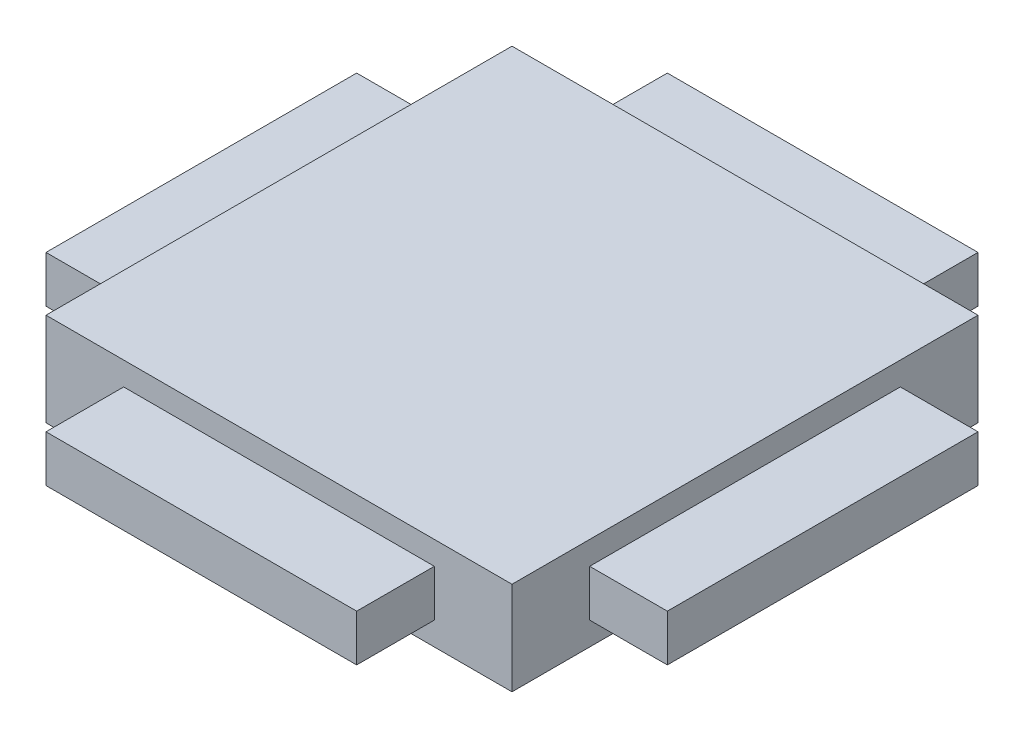
ISO-10303-21;
HEADER;
FILE_DESCRIPTION(('STEP AP214'),'2;1');
FILE_NAME('part.step','',(''),(''),'','','');
FILE_SCHEMA(('AUTOMOTIVE_DESIGN { 1 0 10303 214 1 1 1 1 }'));
ENDSEC;
DATA;
#1=APPLICATION_CONTEXT('core data for automotive mechanical design processes');
#2=APPLICATION_PROTOCOL_DEFINITION('international standard','automotive_design',2000,#1);
#3=PRODUCT_CONTEXT('',#1,'mechanical');
#4=PRODUCT('Part','Part','',(#3));
#5=PRODUCT_RELATED_PRODUCT_CATEGORY('part','',(#4));
#6=PRODUCT_DEFINITION_FORMATION('','',#4);
#7=PRODUCT_DEFINITION_CONTEXT('part definition',#1,'design');
#8=PRODUCT_DEFINITION('design','',#6,#7);
#9=PRODUCT_DEFINITION_SHAPE('','',#8);
#10=(LENGTH_UNIT() NAMED_UNIT(*) SI_UNIT(.MILLI.,.METRE.));
#11=(NAMED_UNIT(*) PLANE_ANGLE_UNIT() SI_UNIT($,.RADIAN.));
#12=(NAMED_UNIT(*) SI_UNIT($,.STERADIAN.) SOLID_ANGLE_UNIT());
#13=UNCERTAINTY_MEASURE_WITH_UNIT(LENGTH_MEASURE(1.E-05),#10,'distance_accuracy_value','');
#14=(GEOMETRIC_REPRESENTATION_CONTEXT(3) GLOBAL_UNCERTAINTY_ASSIGNED_CONTEXT((#13)) GLOBAL_UNIT_ASSIGNED_CONTEXT((#10,
#11,#12)) REPRESENTATION_CONTEXT('',''));
#15=CARTESIAN_POINT('',(0.,0.,0.));
#16=DIRECTION('',(0.,0.,1.));
#17=DIRECTION('',(1.,0.,0.));
#18=AXIS2_PLACEMENT_3D('',#15,#16,#17);
#19=CARTESIAN_POINT('',(0.,3.,7.5));
#20=DIRECTION('',(0.,0.,1.));
#21=DIRECTION('',(1.,0.,0.));
#22=AXIS2_PLACEMENT_3D('',#19,#20,#21);
#23=PLANE('',#22);
#24=DIRECTION('',(-1.,0.,0.));
#25=VECTOR('',#24,1.);
#26=CARTESIAN_POINT('',(0.,0.,7.5));
#27=LINE('',#26,#25);
#28=CARTESIAN_POINT('',(7.5,0.,7.5));
#29=VERTEX_POINT('',#28);
#30=CARTESIAN_POINT('',(-7.5,0.,7.5));
#31=VERTEX_POINT('',#30);
#32=EDGE_CURVE('E306',#29,#31,#27,.T.);
#33=ORIENTED_EDGE('',*,*,#32,.F.);
#34=DIRECTION('',(0.,-1.,0.));
#35=VECTOR('',#34,1.);
#36=CARTESIAN_POINT('',(7.5,3.,7.5));
#37=LINE('',#36,#35);
#38=CARTESIAN_POINT('',(7.5,3.,7.5));
#39=VERTEX_POINT('',#38);
#40=EDGE_CURVE('E44',#39,#29,#37,.T.);
#41=ORIENTED_EDGE('',*,*,#40,.F.);
#42=DIRECTION('',(-1.,0.,0.));
#43=VECTOR('',#42,1.);
#44=CARTESIAN_POINT('',(0.,3.,7.5));
#45=LINE('',#44,#43);
#46=CARTESIAN_POINT('',(-7.5,3.,7.5));
#47=VERTEX_POINT('',#46);
#48=EDGE_CURVE('E295',#39,#47,#45,.T.);
#49=ORIENTED_EDGE('',*,*,#48,.T.);
#50=DIRECTION('',(0.,-1.,0.));
#51=VECTOR('',#50,1.);
#52=CARTESIAN_POINT('',(-7.5,3.,7.5));
#53=LINE('',#52,#51);
#54=EDGE_CURVE('E11',#47,#31,#53,.T.);
#55=ORIENTED_EDGE('',*,*,#54,.T.);
#56=EDGE_LOOP('',(#33,#41,#49,#55));
#57=FACE_BOUND('',#56,.T.);
#58=DIRECTION('',(0.,1.,0.));
#59=VECTOR('',#58,1.);
#60=CARTESIAN_POINT('',(-5.,0.75,7.5));
#61=LINE('',#60,#59);
#62=CARTESIAN_POINT('',(-5.,0.75,7.5));
#63=VERTEX_POINT('',#62);
#64=CARTESIAN_POINT('',(-5.,2.25,7.5));
#65=VERTEX_POINT('',#64);
#66=EDGE_CURVE('E222',#63,#65,#61,.T.);
#67=ORIENTED_EDGE('',*,*,#66,.T.);
#68=DIRECTION('',(1.,0.,0.));
#69=VECTOR('',#68,1.);
#70=CARTESIAN_POINT('',(0.,2.25,7.5));
#71=LINE('',#70,#69);
#72=CARTESIAN_POINT('',(5.,2.25,7.5));
#73=VERTEX_POINT('',#72);
#74=EDGE_CURVE('E59',#65,#73,#71,.T.);
#75=ORIENTED_EDGE('',*,*,#74,.T.);
#76=DIRECTION('',(0.,1.,0.));
#77=VECTOR('',#76,1.);
#78=CARTESIAN_POINT('',(5.,0.75,7.5));
#79=LINE('',#78,#77);
#80=CARTESIAN_POINT('',(5.,0.75,7.5));
#81=VERTEX_POINT('',#80);
#82=EDGE_CURVE('E226',#81,#73,#79,.T.);
#83=ORIENTED_EDGE('',*,*,#82,.F.);
#84=DIRECTION('',(1.,0.,0.));
#85=VECTOR('',#84,1.);
#86=CARTESIAN_POINT('',(0.,0.75,7.5));
#87=LINE('',#86,#85);
#88=EDGE_CURVE('E219',#63,#81,#87,.T.);
#89=ORIENTED_EDGE('',*,*,#88,.F.);
#90=EDGE_LOOP('',(#67,#75,#83,#89));
#91=FACE_BOUND('',#90,.T.);
#92=ADVANCED_FACE('F36',(#57,#91),#23,.T.);
#93=CARTESIAN_POINT('',(-7.5,3.,0.));
#94=DIRECTION('',(-1.,0.,0.));
#95=DIRECTION('',(0.,0.,1.));
#96=AXIS2_PLACEMENT_3D('',#93,#94,#95);
#97=PLANE('',#96);
#98=DIRECTION('',(0.,0.,-1.));
#99=VECTOR('',#98,1.);
#100=CARTESIAN_POINT('',(-7.5,0.,0.));
#101=LINE('',#100,#99);
#102=CARTESIAN_POINT('',(-7.5,0.,-7.5));
#103=VERTEX_POINT('',#102);
#104=EDGE_CURVE('E285',#31,#103,#101,.T.);
#105=ORIENTED_EDGE('',*,*,#104,.F.);
#106=ORIENTED_EDGE('',*,*,#54,.F.);
#107=DIRECTION('',(0.,0.,-1.));
#108=VECTOR('',#107,1.);
#109=CARTESIAN_POINT('',(-7.5,3.,0.));
#110=LINE('',#109,#108);
#111=CARTESIAN_POINT('',(-7.5,3.,-7.5));
#112=VERTEX_POINT('',#111);
#113=EDGE_CURVE('E292',#47,#112,#110,.T.);
#114=ORIENTED_EDGE('',*,*,#113,.T.);
#115=DIRECTION('',(0.,-1.,0.));
#116=VECTOR('',#115,1.);
#117=CARTESIAN_POINT('',(-7.5,3.,-7.5));
#118=LINE('',#117,#116);
#119=EDGE_CURVE('E303',#112,#103,#118,.T.);
#120=ORIENTED_EDGE('',*,*,#119,.T.);
#121=EDGE_LOOP('',(#105,#106,#114,#120));
#122=FACE_BOUND('',#121,.T.);
#123=DIRECTION('',(0.,1.,0.));
#124=VECTOR('',#123,1.);
#125=CARTESIAN_POINT('',(-7.5,0.75,-5.));
#126=LINE('',#125,#124);
#127=CARTESIAN_POINT('',(-7.5,0.75,-5.));
#128=VERTEX_POINT('',#127);
#129=CARTESIAN_POINT('',(-7.5,2.25,-5.));
#130=VERTEX_POINT('',#129);
#131=EDGE_CURVE('E286',#128,#130,#126,.T.);
#132=ORIENTED_EDGE('',*,*,#131,.T.);
#133=DIRECTION('',(0.,0.,1.));
#134=VECTOR('',#133,1.);
#135=CARTESIAN_POINT('',(-7.5,2.25,0.));
#136=LINE('',#135,#134);
#137=CARTESIAN_POINT('',(-7.5,2.25,5.));
#138=VERTEX_POINT('',#137);
#139=EDGE_CURVE('E267',#130,#138,#136,.T.);
#140=ORIENTED_EDGE('',*,*,#139,.T.);
#141=DIRECTION('',(0.,1.,0.));
#142=VECTOR('',#141,1.);
#143=CARTESIAN_POINT('',(-7.5,0.75,5.));
#144=LINE('',#143,#142);
#145=CARTESIAN_POINT('',(-7.5,0.75,5.));
#146=VERTEX_POINT('',#145);
#147=EDGE_CURVE('E289',#146,#138,#144,.T.);
#148=ORIENTED_EDGE('',*,*,#147,.F.);
#149=DIRECTION('',(0.,0.,1.));
#150=VECTOR('',#149,1.);
#151=CARTESIAN_POINT('',(-7.5,0.75,0.));
#152=LINE('',#151,#150);
#153=EDGE_CURVE('E277',#128,#146,#152,.T.);
#154=ORIENTED_EDGE('',*,*,#153,.F.);
#155=EDGE_LOOP('',(#132,#140,#148,#154));
#156=FACE_BOUND('',#155,.T.);
#157=ADVANCED_FACE('F38',(#122,#156),#97,.T.);
#158=CARTESIAN_POINT('',(7.5,3.,0.));
#159=DIRECTION('',(-1.,0.,0.));
#160=DIRECTION('',(0.,0.,1.));
#161=AXIS2_PLACEMENT_3D('',#158,#159,#160);
#162=PLANE('',#161);
#163=DIRECTION('',(0.,0.,-1.));
#164=VECTOR('',#163,1.);
#165=CARTESIAN_POINT('',(7.5,2.25,0.));
#166=LINE('',#165,#164);
#167=CARTESIAN_POINT('',(7.5,2.25,5.));
#168=VERTEX_POINT('',#167);
#169=CARTESIAN_POINT('',(7.5,2.25,-5.));
#170=VERTEX_POINT('',#169);
#171=EDGE_CURVE('E241',#168,#170,#166,.T.);
#172=ORIENTED_EDGE('',*,*,#171,.T.);
#173=DIRECTION('',(0.,-1.,0.));
#174=VECTOR('',#173,1.);
#175=CARTESIAN_POINT('',(7.5,2.25,-5.));
#176=LINE('',#175,#174);
#177=CARTESIAN_POINT('',(7.5,0.75,-5.));
#178=VERTEX_POINT('',#177);
#179=EDGE_CURVE('E252',#170,#178,#176,.T.);
#180=ORIENTED_EDGE('',*,*,#179,.T.);
#181=DIRECTION('',(0.,0.,-1.));
#182=VECTOR('',#181,1.);
#183=CARTESIAN_POINT('',(7.5,0.75,0.));
#184=LINE('',#183,#182);
#185=CARTESIAN_POINT('',(7.5,0.75,5.));
#186=VERTEX_POINT('',#185);
#187=EDGE_CURVE('E225',#186,#178,#184,.T.);
#188=ORIENTED_EDGE('',*,*,#187,.F.);
#189=DIRECTION('',(0.,-1.,0.));
#190=VECTOR('',#189,1.);
#191=CARTESIAN_POINT('',(7.5,2.25,5.));
#192=LINE('',#191,#190);
#193=EDGE_CURVE('E259',#168,#186,#192,.T.);
#194=ORIENTED_EDGE('',*,*,#193,.F.);
#195=EDGE_LOOP('',(#172,#180,#188,#194));
#196=FACE_BOUND('',#195,.T.);
#197=DIRECTION('',(0.,0.,-1.));
#198=VECTOR('',#197,1.);
#199=CARTESIAN_POINT('',(7.5,0.,0.));
#200=LINE('',#199,#198);
#201=CARTESIAN_POINT('',(7.5,0.,-7.5));
#202=VERTEX_POINT('',#201);
#203=EDGE_CURVE('E309',#29,#202,#200,.T.);
#204=ORIENTED_EDGE('',*,*,#203,.T.);
#205=DIRECTION('',(0.,-1.,0.));
#206=VECTOR('',#205,1.);
#207=CARTESIAN_POINT('',(7.5,3.,-7.5));
#208=LINE('',#207,#206);
#209=CARTESIAN_POINT('',(7.5,3.,-7.5));
#210=VERTEX_POINT('',#209);
#211=EDGE_CURVE('E314',#210,#202,#208,.T.);
#212=ORIENTED_EDGE('',*,*,#211,.F.);
#213=DIRECTION('',(0.,0.,-1.));
#214=VECTOR('',#213,1.);
#215=CARTESIAN_POINT('',(7.5,3.,0.));
#216=LINE('',#215,#214);
#217=EDGE_CURVE('E299',#39,#210,#216,.T.);
#218=ORIENTED_EDGE('',*,*,#217,.F.);
#219=ORIENTED_EDGE('',*,*,#40,.T.);
#220=EDGE_LOOP('',(#204,#212,#218,#219));
#221=FACE_BOUND('',#220,.T.);
#222=ADVANCED_FACE('F319',(#196,#221),#162,.F.);
#223=CARTESIAN_POINT('',(0.,3.,-7.5));
#224=DIRECTION('',(0.,0.,1.));
#225=DIRECTION('',(1.,0.,0.));
#226=AXIS2_PLACEMENT_3D('',#223,#224,#225);
#227=PLANE('',#226);
#228=DIRECTION('',(-1.,0.,0.));
#229=VECTOR('',#228,1.);
#230=CARTESIAN_POINT('',(0.,2.25,-7.5));
#231=LINE('',#230,#229);
#232=CARTESIAN_POINT('',(5.,2.25,-7.5));
#233=VERTEX_POINT('',#232);
#234=CARTESIAN_POINT('',(-5.,2.25,-7.5));
#235=VERTEX_POINT('',#234);
#236=EDGE_CURVE('E197',#233,#235,#231,.T.);
#237=ORIENTED_EDGE('',*,*,#236,.T.);
#238=DIRECTION('',(0.,-1.,0.));
#239=VECTOR('',#238,1.);
#240=CARTESIAN_POINT('',(-5.,2.25,-7.5));
#241=LINE('',#240,#239);
#242=CARTESIAN_POINT('',(-5.,0.75,-7.5));
#243=VERTEX_POINT('',#242);
#244=EDGE_CURVE('E190',#235,#243,#241,.T.);
#245=ORIENTED_EDGE('',*,*,#244,.T.);
#246=DIRECTION('',(-1.,0.,0.));
#247=VECTOR('',#246,1.);
#248=CARTESIAN_POINT('',(0.,0.75,-7.5));
#249=LINE('',#248,#247);
#250=CARTESIAN_POINT('',(5.,0.75,-7.5));
#251=VERTEX_POINT('',#250);
#252=EDGE_CURVE('E176',#251,#243,#249,.T.);
#253=ORIENTED_EDGE('',*,*,#252,.F.);
#254=DIRECTION('',(0.,-1.,0.));
#255=VECTOR('',#254,1.);
#256=CARTESIAN_POINT('',(5.,2.25,-7.5));
#257=LINE('',#256,#255);
#258=EDGE_CURVE('E199',#233,#251,#257,.T.);
#259=ORIENTED_EDGE('',*,*,#258,.F.);
#260=EDGE_LOOP('',(#237,#245,#253,#259));
#261=FACE_BOUND('',#260,.T.);
#262=DIRECTION('',(-1.,0.,0.));
#263=VECTOR('',#262,1.);
#264=CARTESIAN_POINT('',(0.,0.,-7.5));
#265=LINE('',#264,#263);
#266=EDGE_CURVE('E296',#202,#103,#265,.T.);
#267=ORIENTED_EDGE('',*,*,#266,.T.);
#268=ORIENTED_EDGE('',*,*,#119,.F.);
#269=DIRECTION('',(-1.,0.,0.));
#270=VECTOR('',#269,1.);
#271=CARTESIAN_POINT('',(0.,3.,-7.5));
#272=LINE('',#271,#270);
#273=EDGE_CURVE('E301',#210,#112,#272,.T.);
#274=ORIENTED_EDGE('',*,*,#273,.F.);
#275=ORIENTED_EDGE('',*,*,#211,.T.);
#276=EDGE_LOOP('',(#267,#268,#274,#275));
#277=FACE_BOUND('',#276,.T.);
#278=ADVANCED_FACE('F195',(#261,#277),#227,.F.);
#279=CARTESIAN_POINT('',(0.,3.,0.));
#280=DIRECTION('',(0.,1.,0.));
#281=DIRECTION('',(0.,0.,1.));
#282=AXIS2_PLACEMENT_3D('',#279,#280,#281);
#283=PLANE('',#282);
#284=ORIENTED_EDGE('',*,*,#113,.F.);
#285=ORIENTED_EDGE('',*,*,#48,.F.);
#286=ORIENTED_EDGE('',*,*,#217,.T.);
#287=ORIENTED_EDGE('',*,*,#273,.T.);
#288=EDGE_LOOP('',(#284,#285,#286,#287));
#289=FACE_BOUND('',#288,.T.);
#290=ADVANCED_FACE('F335',(#289),#283,.T.);
#291=CARTESIAN_POINT('',(0.,0.,0.));
#292=DIRECTION('',(0.,1.,0.));
#293=DIRECTION('',(0.,0.,1.));
#294=AXIS2_PLACEMENT_3D('',#291,#292,#293);
#295=PLANE('',#294);
#296=ORIENTED_EDGE('',*,*,#104,.T.);
#297=ORIENTED_EDGE('',*,*,#266,.F.);
#298=ORIENTED_EDGE('',*,*,#203,.F.);
#299=ORIENTED_EDGE('',*,*,#32,.T.);
#300=EDGE_LOOP('',(#296,#297,#298,#299));
#301=FACE_BOUND('',#300,.T.);
#302=ADVANCED_FACE('F326',(#301),#295,.F.);
#303=CARTESIAN_POINT('',(-10.,0.75,0.));
#304=DIRECTION('',(1.,0.,0.));
#305=DIRECTION('',(0.,0.,-1.));
#306=AXIS2_PLACEMENT_3D('',#303,#304,#305);
#307=PLANE('',#306);
#308=DIRECTION('',(0.,0.,-1.));
#309=VECTOR('',#308,1.);
#310=CARTESIAN_POINT('',(-10.,2.25,0.));
#311=LINE('',#310,#309);
#312=CARTESIAN_POINT('',(-10.,2.25,5.));
#313=VERTEX_POINT('',#312);
#314=CARTESIAN_POINT('',(-10.,2.25,-5.));
#315=VERTEX_POINT('',#314);
#316=EDGE_CURVE('E261',#313,#315,#311,.T.);
#317=ORIENTED_EDGE('',*,*,#316,.T.);
#318=DIRECTION('',(0.,1.,0.));
#319=VECTOR('',#318,1.);
#320=CARTESIAN_POINT('',(-10.,0.75,-5.));
#321=LINE('',#320,#319);
#322=CARTESIAN_POINT('',(-10.,0.75,-5.));
#323=VERTEX_POINT('',#322);
#324=EDGE_CURVE('E283',#323,#315,#321,.T.);
#325=ORIENTED_EDGE('',*,*,#324,.F.);
#326=DIRECTION('',(0.,0.,-1.));
#327=VECTOR('',#326,1.);
#328=CARTESIAN_POINT('',(-10.,0.75,0.));
#329=LINE('',#328,#327);
#330=CARTESIAN_POINT('',(-10.,0.75,5.));
#331=VERTEX_POINT('',#330);
#332=EDGE_CURVE('E273',#331,#323,#329,.T.);
#333=ORIENTED_EDGE('',*,*,#332,.F.);
#334=DIRECTION('',(0.,1.,0.));
#335=VECTOR('',#334,1.);
#336=CARTESIAN_POINT('',(-10.,0.75,5.));
#337=LINE('',#336,#335);
#338=EDGE_CURVE('E282',#331,#313,#337,.T.);
#339=ORIENTED_EDGE('',*,*,#338,.T.);
#340=EDGE_LOOP('',(#317,#325,#333,#339));
#341=FACE_BOUND('',#340,.T.);
#342=ADVANCED_FACE('F342',(#341),#307,.F.);
#343=CARTESIAN_POINT('',(0.,0.75,-5.));
#344=DIRECTION('',(0.,0.,-1.));
#345=DIRECTION('',(-1.,0.,0.));
#346=AXIS2_PLACEMENT_3D('',#343,#344,#345);
#347=PLANE('',#346);
#348=DIRECTION('',(-1.,0.,0.));
#349=VECTOR('',#348,1.);
#350=CARTESIAN_POINT('',(0.,2.25,-5.));
#351=LINE('',#350,#349);
#352=EDGE_CURVE('E270',#130,#315,#351,.T.);
#353=ORIENTED_EDGE('',*,*,#352,.F.);
#354=ORIENTED_EDGE('',*,*,#131,.F.);
#355=DIRECTION('',(-1.,0.,0.));
#356=VECTOR('',#355,1.);
#357=CARTESIAN_POINT('',(0.,0.75,-5.));
#358=LINE('',#357,#356);
#359=EDGE_CURVE('E279',#128,#323,#358,.T.);
#360=ORIENTED_EDGE('',*,*,#359,.T.);
#361=ORIENTED_EDGE('',*,*,#324,.T.);
#362=EDGE_LOOP('',(#353,#354,#360,#361));
#363=FACE_BOUND('',#362,.T.);
#364=ADVANCED_FACE('F402',(#363),#347,.T.);
#365=CARTESIAN_POINT('',(0.,0.75,5.));
#366=DIRECTION('',(0.,0.,-1.));
#367=DIRECTION('',(-1.,0.,0.));
#368=AXIS2_PLACEMENT_3D('',#365,#366,#367);
#369=PLANE('',#368);
#370=DIRECTION('',(-1.,0.,0.));
#371=VECTOR('',#370,1.);
#372=CARTESIAN_POINT('',(0.,2.25,5.));
#373=LINE('',#372,#371);
#374=EDGE_CURVE('E264',#138,#313,#373,.T.);
#375=ORIENTED_EDGE('',*,*,#374,.T.);
#376=ORIENTED_EDGE('',*,*,#338,.F.);
#377=DIRECTION('',(-1.,0.,0.));
#378=VECTOR('',#377,1.);
#379=CARTESIAN_POINT('',(0.,0.75,5.));
#380=LINE('',#379,#378);
#381=EDGE_CURVE('E275',#146,#331,#380,.T.);
#382=ORIENTED_EDGE('',*,*,#381,.F.);
#383=ORIENTED_EDGE('',*,*,#147,.T.);
#384=EDGE_LOOP('',(#375,#376,#382,#383));
#385=FACE_BOUND('',#384,.T.);
#386=ADVANCED_FACE('F400',(#385),#369,.F.);
#387=CARTESIAN_POINT('',(0.,0.75,0.));
#388=DIRECTION('',(0.,1.,0.));
#389=DIRECTION('',(0.,0.,1.));
#390=AXIS2_PLACEMENT_3D('',#387,#388,#389);
#391=PLANE('',#390);
#392=ORIENTED_EDGE('',*,*,#332,.T.);
#393=ORIENTED_EDGE('',*,*,#359,.F.);
#394=ORIENTED_EDGE('',*,*,#153,.T.);
#395=ORIENTED_EDGE('',*,*,#381,.T.);
#396=EDGE_LOOP('',(#392,#393,#394,#395));
#397=FACE_BOUND('',#396,.T.);
#398=ADVANCED_FACE('F396',(#397),#391,.F.);
#399=CARTESIAN_POINT('',(0.,2.25,0.));
#400=DIRECTION('',(0.,1.,0.));
#401=DIRECTION('',(0.,0.,1.));
#402=AXIS2_PLACEMENT_3D('',#399,#400,#401);
#403=PLANE('',#402);
#404=ORIENTED_EDGE('',*,*,#316,.F.);
#405=ORIENTED_EDGE('',*,*,#374,.F.);
#406=ORIENTED_EDGE('',*,*,#139,.F.);
#407=ORIENTED_EDGE('',*,*,#352,.T.);
#408=EDGE_LOOP('',(#404,#405,#406,#407));
#409=FACE_BOUND('',#408,.T.);
#410=ADVANCED_FACE('F393',(#409),#403,.T.);
#411=CARTESIAN_POINT('',(0.,2.25,5.));
#412=DIRECTION('',(0.,0.,1.));
#413=DIRECTION('',(1.,0.,0.));
#414=AXIS2_PLACEMENT_3D('',#411,#412,#413);
#415=PLANE('',#414);
#416=ORIENTED_EDGE('',*,*,#193,.T.);
#417=DIRECTION('',(-1.,0.,0.));
#418=VECTOR('',#417,1.);
#419=CARTESIAN_POINT('',(0.,0.75,5.));
#420=LINE('',#419,#418);
#421=CARTESIAN_POINT('',(10.,0.75,5.));
#422=VERTEX_POINT('',#421);
#423=EDGE_CURVE('E232',#422,#186,#420,.T.);
#424=ORIENTED_EDGE('',*,*,#423,.F.);
#425=DIRECTION('',(0.,-1.,0.));
#426=VECTOR('',#425,1.);
#427=CARTESIAN_POINT('',(10.,2.25,5.));
#428=LINE('',#427,#426);
#429=CARTESIAN_POINT('',(10.,2.25,5.));
#430=VERTEX_POINT('',#429);
#431=EDGE_CURVE('E257',#430,#422,#428,.T.);
#432=ORIENTED_EDGE('',*,*,#431,.F.);
#433=DIRECTION('',(-1.,0.,0.));
#434=VECTOR('',#433,1.);
#435=CARTESIAN_POINT('',(0.,2.25,5.));
#436=LINE('',#435,#434);
#437=EDGE_CURVE('E244',#430,#168,#436,.T.);
#438=ORIENTED_EDGE('',*,*,#437,.T.);
#439=EDGE_LOOP('',(#416,#424,#432,#438));
#440=FACE_BOUND('',#439,.T.);
#441=ADVANCED_FACE('F362',(#440),#415,.T.);
#442=CARTESIAN_POINT('',(10.,2.25,0.));
#443=DIRECTION('',(-1.,0.,0.));
#444=DIRECTION('',(0.,0.,1.));
#445=AXIS2_PLACEMENT_3D('',#442,#443,#444);
#446=PLANE('',#445);
#447=ORIENTED_EDGE('',*,*,#431,.T.);
#448=DIRECTION('',(0.,0.,-1.));
#449=VECTOR('',#448,1.);
#450=CARTESIAN_POINT('',(10.,0.75,0.));
#451=LINE('',#450,#449);
#452=CARTESIAN_POINT('',(10.,0.75,-5.));
#453=VERTEX_POINT('',#452);
#454=EDGE_CURVE('E235',#422,#453,#451,.T.);
#455=ORIENTED_EDGE('',*,*,#454,.T.);
#456=DIRECTION('',(0.,-1.,0.));
#457=VECTOR('',#456,1.);
#458=CARTESIAN_POINT('',(10.,2.25,-5.));
#459=LINE('',#458,#457);
#460=CARTESIAN_POINT('',(10.,2.25,-5.));
#461=VERTEX_POINT('',#460);
#462=EDGE_CURVE('E255',#461,#453,#459,.T.);
#463=ORIENTED_EDGE('',*,*,#462,.F.);
#464=DIRECTION('',(0.,0.,-1.));
#465=VECTOR('',#464,1.);
#466=CARTESIAN_POINT('',(10.,2.25,0.));
#467=LINE('',#466,#465);
#468=EDGE_CURVE('E247',#430,#461,#467,.T.);
#469=ORIENTED_EDGE('',*,*,#468,.F.);
#470=EDGE_LOOP('',(#447,#455,#463,#469));
#471=FACE_BOUND('',#470,.T.);
#472=ADVANCED_FACE('F368',(#471),#446,.F.);
#473=CARTESIAN_POINT('',(0.,2.25,-5.));
#474=DIRECTION('',(0.,0.,1.));
#475=DIRECTION('',(1.,0.,0.));
#476=AXIS2_PLACEMENT_3D('',#473,#474,#475);
#477=PLANE('',#476);
#478=ORIENTED_EDGE('',*,*,#462,.T.);
#479=DIRECTION('',(-1.,0.,0.));
#480=VECTOR('',#479,1.);
#481=CARTESIAN_POINT('',(0.,0.75,-5.));
#482=LINE('',#481,#480);
#483=EDGE_CURVE('E238',#453,#178,#482,.T.);
#484=ORIENTED_EDGE('',*,*,#483,.T.);
#485=ORIENTED_EDGE('',*,*,#179,.F.);
#486=DIRECTION('',(-1.,0.,0.));
#487=VECTOR('',#486,1.);
#488=CARTESIAN_POINT('',(0.,2.25,-5.));
#489=LINE('',#488,#487);
#490=EDGE_CURVE('E249',#461,#170,#489,.T.);
#491=ORIENTED_EDGE('',*,*,#490,.F.);
#492=EDGE_LOOP('',(#478,#484,#485,#491));
#493=FACE_BOUND('',#492,.T.);
#494=ADVANCED_FACE('F371',(#493),#477,.F.);
#495=CARTESIAN_POINT('',(0.,2.25,0.));
#496=DIRECTION('',(0.,1.,0.));
#497=DIRECTION('',(0.,0.,1.));
#498=AXIS2_PLACEMENT_3D('',#495,#496,#497);
#499=PLANE('',#498);
#500=ORIENTED_EDGE('',*,*,#171,.F.);
#501=ORIENTED_EDGE('',*,*,#437,.F.);
#502=ORIENTED_EDGE('',*,*,#468,.T.);
#503=ORIENTED_EDGE('',*,*,#490,.T.);
#504=EDGE_LOOP('',(#500,#501,#502,#503));
#505=FACE_BOUND('',#504,.T.);
#506=ADVANCED_FACE('F359',(#505),#499,.T.);
#507=CARTESIAN_POINT('',(0.,0.75,0.));
#508=DIRECTION('',(0.,1.,0.));
#509=DIRECTION('',(0.,0.,1.));
#510=AXIS2_PLACEMENT_3D('',#507,#508,#509);
#511=PLANE('',#510);
#512=ORIENTED_EDGE('',*,*,#187,.T.);
#513=ORIENTED_EDGE('',*,*,#483,.F.);
#514=ORIENTED_EDGE('',*,*,#454,.F.);
#515=ORIENTED_EDGE('',*,*,#423,.T.);
#516=EDGE_LOOP('',(#512,#513,#514,#515));
#517=FACE_BOUND('',#516,.T.);
#518=ADVANCED_FACE('F373',(#517),#511,.F.);
#519=CARTESIAN_POINT('',(-5.,0.75,0.));
#520=DIRECTION('',(1.,0.,0.));
#521=DIRECTION('',(0.,0.,-1.));
#522=AXIS2_PLACEMENT_3D('',#519,#520,#521);
#523=PLANE('',#522);
#524=DIRECTION('',(0.,0.,-1.));
#525=VECTOR('',#524,1.);
#526=CARTESIAN_POINT('',(-5.,2.25,0.));
#527=LINE('',#526,#525);
#528=CARTESIAN_POINT('',(-5.,2.25,10.));
#529=VERTEX_POINT('',#528);
#530=EDGE_CURVE('E198',#529,#65,#527,.T.);
#531=ORIENTED_EDGE('',*,*,#530,.T.);
#532=ORIENTED_EDGE('',*,*,#66,.F.);
#533=DIRECTION('',(0.,0.,-1.));
#534=VECTOR('',#533,1.);
#535=CARTESIAN_POINT('',(-5.,0.75,0.));
#536=LINE('',#535,#534);
#537=CARTESIAN_POINT('',(-5.,0.75,10.));
#538=VERTEX_POINT('',#537);
#539=EDGE_CURVE('E212',#538,#63,#536,.T.);
#540=ORIENTED_EDGE('',*,*,#539,.F.);
#541=DIRECTION('',(0.,1.,0.));
#542=VECTOR('',#541,1.);
#543=CARTESIAN_POINT('',(-5.,0.75,10.));
#544=LINE('',#543,#542);
#545=EDGE_CURVE('E221',#538,#529,#544,.T.);
#546=ORIENTED_EDGE('',*,*,#545,.T.);
#547=EDGE_LOOP('',(#531,#532,#540,#546));
#548=FACE_BOUND('',#547,.T.);
#549=ADVANCED_FACE('F375',(#548),#523,.F.);
#550=CARTESIAN_POINT('',(5.,0.75,0.));
#551=DIRECTION('',(1.,0.,0.));
#552=DIRECTION('',(0.,0.,-1.));
#553=AXIS2_PLACEMENT_3D('',#550,#551,#552);
#554=PLANE('',#553);
#555=DIRECTION('',(0.,0.,-1.));
#556=VECTOR('',#555,1.);
#557=CARTESIAN_POINT('',(5.,2.25,0.));
#558=LINE('',#557,#556);
#559=CARTESIAN_POINT('',(5.,2.25,10.));
#560=VERTEX_POINT('',#559);
#561=EDGE_CURVE('E209',#560,#73,#558,.T.);
#562=ORIENTED_EDGE('',*,*,#561,.F.);
#563=DIRECTION('',(0.,1.,0.));
#564=VECTOR('',#563,1.);
#565=CARTESIAN_POINT('',(5.,0.75,10.));
#566=LINE('',#565,#564);
#567=CARTESIAN_POINT('',(5.,0.75,10.));
#568=VERTEX_POINT('',#567);
#569=EDGE_CURVE('E228',#568,#560,#566,.T.);
#570=ORIENTED_EDGE('',*,*,#569,.F.);
#571=DIRECTION('',(0.,0.,-1.));
#572=VECTOR('',#571,1.);
#573=CARTESIAN_POINT('',(5.,0.75,0.));
#574=LINE('',#573,#572);
#575=EDGE_CURVE('E216',#568,#81,#574,.T.);
#576=ORIENTED_EDGE('',*,*,#575,.T.);
#577=ORIENTED_EDGE('',*,*,#82,.T.);
#578=EDGE_LOOP('',(#562,#570,#576,#577));
#579=FACE_BOUND('',#578,.T.);
#580=ADVANCED_FACE('F381',(#579),#554,.T.);
#581=CARTESIAN_POINT('',(0.,0.75,10.));
#582=DIRECTION('',(0.,0.,-1.));
#583=DIRECTION('',(-1.,0.,0.));
#584=AXIS2_PLACEMENT_3D('',#581,#582,#583);
#585=PLANE('',#584);
#586=DIRECTION('',(-1.,0.,0.));
#587=VECTOR('',#586,1.);
#588=CARTESIAN_POINT('',(0.,2.25,10.));
#589=LINE('',#588,#587);
#590=EDGE_CURVE('E201',#560,#529,#589,.T.);
#591=ORIENTED_EDGE('',*,*,#590,.T.);
#592=ORIENTED_EDGE('',*,*,#545,.F.);
#593=DIRECTION('',(-1.,0.,0.));
#594=VECTOR('',#593,1.);
#595=CARTESIAN_POINT('',(0.,0.75,10.));
#596=LINE('',#595,#594);
#597=EDGE_CURVE('E214',#568,#538,#596,.T.);
#598=ORIENTED_EDGE('',*,*,#597,.F.);
#599=ORIENTED_EDGE('',*,*,#569,.T.);
#600=EDGE_LOOP('',(#591,#592,#598,#599));
#601=FACE_BOUND('',#600,.T.);
#602=ADVANCED_FACE('F476',(#601),#585,.F.);
#603=CARTESIAN_POINT('',(0.,0.75,0.));
#604=DIRECTION('',(0.,1.,0.));
#605=DIRECTION('',(0.,0.,1.));
#606=AXIS2_PLACEMENT_3D('',#603,#604,#605);
#607=PLANE('',#606);
#608=ORIENTED_EDGE('',*,*,#539,.T.);
#609=ORIENTED_EDGE('',*,*,#88,.T.);
#610=ORIENTED_EDGE('',*,*,#575,.F.);
#611=ORIENTED_EDGE('',*,*,#597,.T.);
#612=EDGE_LOOP('',(#608,#609,#610,#611));
#613=FACE_BOUND('',#612,.T.);
#614=ADVANCED_FACE('F486',(#613),#607,.F.);
#615=CARTESIAN_POINT('',(0.,2.25,0.));
#616=DIRECTION('',(0.,1.,0.));
#617=DIRECTION('',(0.,0.,1.));
#618=AXIS2_PLACEMENT_3D('',#615,#616,#617);
#619=PLANE('',#618);
#620=ORIENTED_EDGE('',*,*,#530,.F.);
#621=ORIENTED_EDGE('',*,*,#590,.F.);
#622=ORIENTED_EDGE('',*,*,#561,.T.);
#623=ORIENTED_EDGE('',*,*,#74,.F.);
#624=EDGE_LOOP('',(#620,#621,#622,#623));
#625=FACE_BOUND('',#624,.T.);
#626=ADVANCED_FACE('F495',(#625),#619,.T.);
#627=CARTESIAN_POINT('',(-5.,2.25,0.));
#628=DIRECTION('',(-1.,0.,0.));
#629=DIRECTION('',(0.,0.,1.));
#630=AXIS2_PLACEMENT_3D('',#627,#628,#629);
#631=PLANE('',#630);
#632=DIRECTION('',(0.,-1.,0.));
#633=VECTOR('',#632,1.);
#634=CARTESIAN_POINT('',(-5.,2.25,-10.));
#635=LINE('',#634,#633);
#636=CARTESIAN_POINT('',(-5.,2.25,-10.));
#637=VERTEX_POINT('',#636);
#638=CARTESIAN_POINT('',(-5.,0.75,-10.));
#639=VERTEX_POINT('',#638);
#640=EDGE_CURVE('E193',#637,#639,#635,.T.);
#641=ORIENTED_EDGE('',*,*,#640,.T.);
#642=DIRECTION('',(0.,0.,-1.));
#643=VECTOR('',#642,1.);
#644=CARTESIAN_POINT('',(-5.,0.75,0.));
#645=LINE('',#644,#643);
#646=EDGE_CURVE('E180',#243,#639,#645,.T.);
#647=ORIENTED_EDGE('',*,*,#646,.F.);
#648=ORIENTED_EDGE('',*,*,#244,.F.);
#649=DIRECTION('',(0.,0.,-1.));
#650=VECTOR('',#649,1.);
#651=CARTESIAN_POINT('',(-5.,2.25,0.));
#652=LINE('',#651,#650);
#653=EDGE_CURVE('E51',#235,#637,#652,.T.);
#654=ORIENTED_EDGE('',*,*,#653,.T.);
#655=EDGE_LOOP('',(#641,#647,#648,#654));
#656=FACE_BOUND('',#655,.T.);
#657=ADVANCED_FACE('F189',(#656),#631,.T.);
#658=CARTESIAN_POINT('',(5.,2.25,0.));
#659=DIRECTION('',(-1.,0.,0.));
#660=DIRECTION('',(0.,0.,1.));
#661=AXIS2_PLACEMENT_3D('',#658,#659,#660);
#662=PLANE('',#661);
#663=ORIENTED_EDGE('',*,*,#258,.T.);
#664=DIRECTION('',(0.,0.,-1.));
#665=VECTOR('',#664,1.);
#666=CARTESIAN_POINT('',(5.,0.75,0.));
#667=LINE('',#666,#665);
#668=CARTESIAN_POINT('',(5.,0.75,-10.));
#669=VERTEX_POINT('',#668);
#670=EDGE_CURVE('E183',#251,#669,#667,.T.);
#671=ORIENTED_EDGE('',*,*,#670,.T.);
#672=DIRECTION('',(0.,-1.,0.));
#673=VECTOR('',#672,1.);
#674=CARTESIAN_POINT('',(5.,2.25,-10.));
#675=LINE('',#674,#673);
#676=CARTESIAN_POINT('',(5.,2.25,-10.));
#677=VERTEX_POINT('',#676);
#678=EDGE_CURVE('E203',#677,#669,#675,.T.);
#679=ORIENTED_EDGE('',*,*,#678,.F.);
#680=DIRECTION('',(0.,0.,-1.));
#681=VECTOR('',#680,1.);
#682=CARTESIAN_POINT('',(5.,2.25,0.));
#683=LINE('',#682,#681);
#684=EDGE_CURVE('E567',#233,#677,#683,.T.);
#685=ORIENTED_EDGE('',*,*,#684,.F.);
#686=EDGE_LOOP('',(#663,#671,#679,#685));
#687=FACE_BOUND('',#686,.T.);
#688=ADVANCED_FACE('F514',(#687),#662,.F.);
#689=CARTESIAN_POINT('',(0.,2.25,-10.));
#690=DIRECTION('',(0.,0.,1.));
#691=DIRECTION('',(1.,0.,0.));
#692=AXIS2_PLACEMENT_3D('',#689,#690,#691);
#693=PLANE('',#692);
#694=ORIENTED_EDGE('',*,*,#678,.T.);
#695=DIRECTION('',(-1.,0.,0.));
#696=VECTOR('',#695,1.);
#697=CARTESIAN_POINT('',(0.,0.75,-10.));
#698=LINE('',#697,#696);
#699=EDGE_CURVE('E560',#669,#639,#698,.T.);
#700=ORIENTED_EDGE('',*,*,#699,.T.);
#701=ORIENTED_EDGE('',*,*,#640,.F.);
#702=DIRECTION('',(-1.,0.,0.));
#703=VECTOR('',#702,1.);
#704=CARTESIAN_POINT('',(0.,2.25,-10.));
#705=LINE('',#704,#703);
#706=EDGE_CURVE('E561',#677,#637,#705,.T.);
#707=ORIENTED_EDGE('',*,*,#706,.F.);
#708=EDGE_LOOP('',(#694,#700,#701,#707));
#709=FACE_BOUND('',#708,.T.);
#710=ADVANCED_FACE('F524',(#709),#693,.F.);
#711=CARTESIAN_POINT('',(0.,2.25,0.));
#712=DIRECTION('',(0.,1.,0.));
#713=DIRECTION('',(0.,0.,1.));
#714=AXIS2_PLACEMENT_3D('',#711,#712,#713);
#715=PLANE('',#714);
#716=ORIENTED_EDGE('',*,*,#653,.F.);
#717=ORIENTED_EDGE('',*,*,#236,.F.);
#718=ORIENTED_EDGE('',*,*,#684,.T.);
#719=ORIENTED_EDGE('',*,*,#706,.T.);
#720=EDGE_LOOP('',(#716,#717,#718,#719));
#721=FACE_BOUND('',#720,.T.);
#722=ADVANCED_FACE('F535',(#721),#715,.T.);
#723=CARTESIAN_POINT('',(0.,0.75,0.));
#724=DIRECTION('',(0.,1.,0.));
#725=DIRECTION('',(0.,0.,1.));
#726=AXIS2_PLACEMENT_3D('',#723,#724,#725);
#727=PLANE('',#726);
#728=ORIENTED_EDGE('',*,*,#646,.T.);
#729=ORIENTED_EDGE('',*,*,#699,.F.);
#730=ORIENTED_EDGE('',*,*,#670,.F.);
#731=ORIENTED_EDGE('',*,*,#252,.T.);
#732=EDGE_LOOP('',(#728,#729,#730,#731));
#733=FACE_BOUND('',#732,.T.);
#734=ADVANCED_FACE('F178',(#733),#727,.F.);
#735=CLOSED_SHELL('',(#92,#157,#222,#278,#290,#302,#342,#364,#386,#398,#410,#441,#472,#494,#506,
#518,#549,#580,#602,#614,#626,#657,#688,#710,#722,#734));
#736=MANIFOLD_SOLID_BREP('B2',#735);
#737=ADVANCED_BREP_SHAPE_REPRESENTATION('',(#18,#736),#14);
#738=SHAPE_DEFINITION_REPRESENTATION(#9,#737);
ENDSEC;
END-ISO-10303-21;
